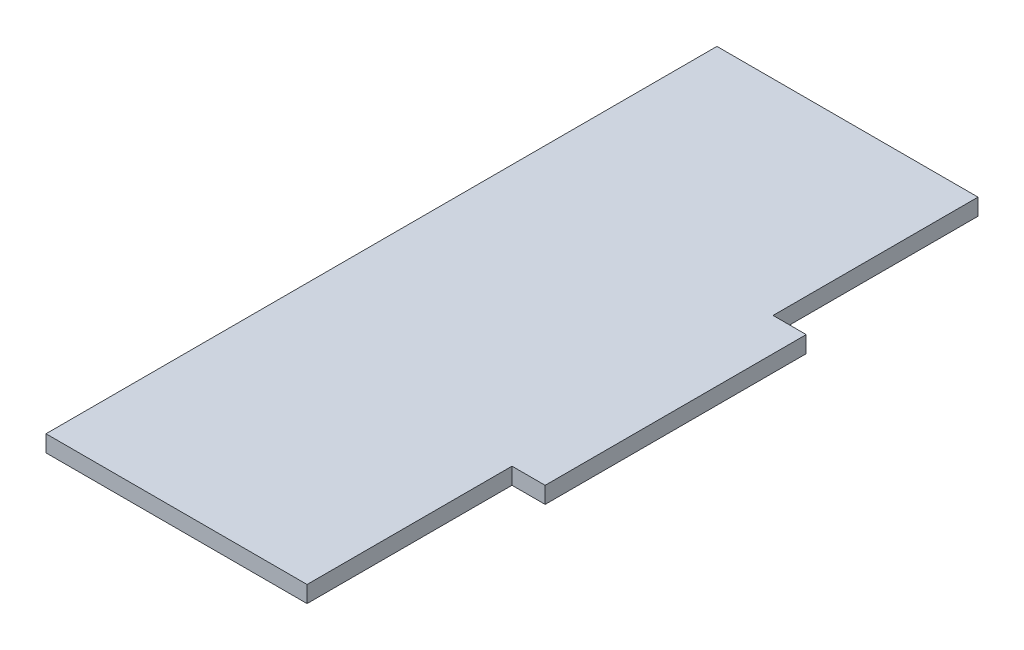
ISO-10303-21;
HEADER;
FILE_DESCRIPTION(('STEP AP214'),'2;1');
FILE_NAME('part.step','',(''),(''),'','','');
FILE_SCHEMA(('AUTOMOTIVE_DESIGN { 1 0 10303 214 1 1 1 1 }'));
ENDSEC;
DATA;
#1=APPLICATION_CONTEXT('core data for automotive mechanical design processes');
#2=APPLICATION_PROTOCOL_DEFINITION('international standard','automotive_design',2000,#1);
#3=PRODUCT_CONTEXT('',#1,'mechanical');
#4=PRODUCT('Part','Part','',(#3));
#5=PRODUCT_RELATED_PRODUCT_CATEGORY('part','',(#4));
#6=PRODUCT_DEFINITION_FORMATION('','',#4);
#7=PRODUCT_DEFINITION_CONTEXT('part definition',#1,'design');
#8=PRODUCT_DEFINITION('design','',#6,#7);
#9=PRODUCT_DEFINITION_SHAPE('','',#8);
#10=(LENGTH_UNIT() NAMED_UNIT(*) SI_UNIT(.MILLI.,.METRE.));
#11=(NAMED_UNIT(*) PLANE_ANGLE_UNIT() SI_UNIT($,.RADIAN.));
#12=(NAMED_UNIT(*) SI_UNIT($,.STERADIAN.) SOLID_ANGLE_UNIT());
#13=UNCERTAINTY_MEASURE_WITH_UNIT(LENGTH_MEASURE(1.E-05),#10,'distance_accuracy_value','');
#14=(GEOMETRIC_REPRESENTATION_CONTEXT(3) GLOBAL_UNCERTAINTY_ASSIGNED_CONTEXT((#13)) GLOBAL_UNIT_ASSIGNED_CONTEXT((#10,
#11,#12)) REPRESENTATION_CONTEXT('',''));
#15=CARTESIAN_POINT('',(0.,0.,0.));
#16=DIRECTION('',(0.,0.,1.));
#17=DIRECTION('',(1.,0.,0.));
#18=AXIS2_PLACEMENT_3D('',#15,#16,#17);
#19=CARTESIAN_POINT('',(-25.,3.175,0.));
#20=DIRECTION('',(-1.,0.,0.));
#21=DIRECTION('',(0.,0.,1.));
#22=AXIS2_PLACEMENT_3D('',#19,#20,#21);
#23=PLANE('',#22);
#24=DIRECTION('',(0.,0.,-1.));
#25=VECTOR('',#24,1.);
#26=CARTESIAN_POINT('',(-25.,0.,0.));
#27=LINE('',#26,#25);
#28=CARTESIAN_POINT('',(-25.,0.,89.25));
#29=VERTEX_POINT('',#28);
#30=CARTESIAN_POINT('',(-25.,0.,-39.25));
#31=VERTEX_POINT('',#30);
#32=EDGE_CURVE('E127',#29,#31,#27,.T.);
#33=ORIENTED_EDGE('',*,*,#32,.F.);
#34=DIRECTION('',(0.,-1.,0.));
#35=VECTOR('',#34,1.);
#36=CARTESIAN_POINT('',(-25.,3.175,89.25));
#37=LINE('',#36,#35);
#38=CARTESIAN_POINT('',(-25.,3.175,89.25));
#39=VERTEX_POINT('',#38);
#40=EDGE_CURVE('E11',#39,#29,#37,.T.);
#41=ORIENTED_EDGE('',*,*,#40,.F.);
#42=DIRECTION('',(0.,0.,-1.));
#43=VECTOR('',#42,1.);
#44=CARTESIAN_POINT('',(-25.,3.175,0.));
#45=LINE('',#44,#43);
#46=CARTESIAN_POINT('',(-25.,3.175,-39.25));
#47=VERTEX_POINT('',#46);
#48=EDGE_CURVE('E147',#39,#47,#45,.T.);
#49=ORIENTED_EDGE('',*,*,#48,.T.);
#50=DIRECTION('',(0.,-1.,0.));
#51=VECTOR('',#50,1.);
#52=CARTESIAN_POINT('',(-25.,3.175,-39.25));
#53=LINE('',#52,#51);
#54=EDGE_CURVE('E50',#47,#31,#53,.T.);
#55=ORIENTED_EDGE('',*,*,#54,.T.);
#56=EDGE_LOOP('',(#33,#41,#49,#55));
#57=FACE_BOUND('',#56,.T.);
#58=ADVANCED_FACE('F34',(#57),#23,.T.);
#59=CARTESIAN_POINT('',(0.,3.175,89.25));
#60=DIRECTION('',(0.,0.,1.));
#61=DIRECTION('',(1.,0.,0.));
#62=AXIS2_PLACEMENT_3D('',#59,#60,#61);
#63=PLANE('',#62);
#64=DIRECTION('',(-1.,0.,0.));
#65=VECTOR('',#64,1.);
#66=CARTESIAN_POINT('',(0.,0.,89.25));
#67=LINE('',#66,#65);
#68=CARTESIAN_POINT('',(25.,0.,89.25));
#69=VERTEX_POINT('',#68);
#70=EDGE_CURVE('E129',#69,#29,#67,.T.);
#71=ORIENTED_EDGE('',*,*,#70,.F.);
#72=DIRECTION('',(0.,-1.,0.));
#73=VECTOR('',#72,1.);
#74=CARTESIAN_POINT('',(25.,3.175,89.25));
#75=LINE('',#74,#73);
#76=CARTESIAN_POINT('',(25.,3.175,89.25));
#77=VERTEX_POINT('',#76);
#78=EDGE_CURVE('E42',#77,#69,#75,.T.);
#79=ORIENTED_EDGE('',*,*,#78,.F.);
#80=DIRECTION('',(-1.,0.,0.));
#81=VECTOR('',#80,1.);
#82=CARTESIAN_POINT('',(0.,3.175,89.25));
#83=LINE('',#82,#81);
#84=EDGE_CURVE('E173',#77,#39,#83,.T.);
#85=ORIENTED_EDGE('',*,*,#84,.T.);
#86=ORIENTED_EDGE('',*,*,#40,.T.);
#87=EDGE_LOOP('',(#71,#79,#85,#86));
#88=FACE_BOUND('',#87,.T.);
#89=ADVANCED_FACE('F164',(#88),#63,.T.);
#90=CARTESIAN_POINT('',(25.,3.175,0.));
#91=DIRECTION('',(1.,0.,0.));
#92=DIRECTION('',(0.,0.,-1.));
#93=AXIS2_PLACEMENT_3D('',#90,#91,#92);
#94=PLANE('',#93);
#95=DIRECTION('',(0.,0.,1.));
#96=VECTOR('',#95,1.);
#97=CARTESIAN_POINT('',(25.,0.,0.));
#98=LINE('',#97,#96);
#99=CARTESIAN_POINT('',(25.,0.,50.));
#100=VERTEX_POINT('',#99);
#101=EDGE_CURVE('E132',#100,#69,#98,.T.);
#102=ORIENTED_EDGE('',*,*,#101,.F.);
#103=DIRECTION('',(0.,-1.,0.));
#104=VECTOR('',#103,1.);
#105=CARTESIAN_POINT('',(25.,3.175,50.));
#106=LINE('',#105,#104);
#107=CARTESIAN_POINT('',(25.,3.175,50.));
#108=VERTEX_POINT('',#107);
#109=EDGE_CURVE('E153',#108,#100,#106,.T.);
#110=ORIENTED_EDGE('',*,*,#109,.F.);
#111=DIRECTION('',(0.,0.,1.));
#112=VECTOR('',#111,1.);
#113=CARTESIAN_POINT('',(25.,3.175,0.));
#114=LINE('',#113,#112);
#115=EDGE_CURVE('E160',#108,#77,#114,.T.);
#116=ORIENTED_EDGE('',*,*,#115,.T.);
#117=ORIENTED_EDGE('',*,*,#78,.T.);
#118=EDGE_LOOP('',(#102,#110,#116,#117));
#119=FACE_BOUND('',#118,.T.);
#120=ADVANCED_FACE('F158',(#119),#94,.T.);
#121=CARTESIAN_POINT('',(0.,3.175,50.));
#122=DIRECTION('',(0.,0.,1.));
#123=DIRECTION('',(1.,0.,0.));
#124=AXIS2_PLACEMENT_3D('',#121,#122,#123);
#125=PLANE('',#124);
#126=DIRECTION('',(-1.,0.,0.));
#127=VECTOR('',#126,1.);
#128=CARTESIAN_POINT('',(0.,0.,50.));
#129=LINE('',#128,#127);
#130=CARTESIAN_POINT('',(31.35,0.,50.));
#131=VERTEX_POINT('',#130);
#132=EDGE_CURVE('E135',#131,#100,#129,.T.);
#133=ORIENTED_EDGE('',*,*,#132,.F.);
#134=DIRECTION('',(0.,-1.,0.));
#135=VECTOR('',#134,1.);
#136=CARTESIAN_POINT('',(31.35,3.175,50.));
#137=LINE('',#136,#135);
#138=CARTESIAN_POINT('',(31.35,3.175,50.));
#139=VERTEX_POINT('',#138);
#140=EDGE_CURVE('E151',#139,#131,#137,.T.);
#141=ORIENTED_EDGE('',*,*,#140,.F.);
#142=DIRECTION('',(-1.,0.,0.));
#143=VECTOR('',#142,1.);
#144=CARTESIAN_POINT('',(0.,3.175,50.));
#145=LINE('',#144,#143);
#146=EDGE_CURVE('E172',#139,#108,#145,.T.);
#147=ORIENTED_EDGE('',*,*,#146,.T.);
#148=ORIENTED_EDGE('',*,*,#109,.T.);
#149=EDGE_LOOP('',(#133,#141,#147,#148));
#150=FACE_BOUND('',#149,.T.);
#151=ADVANCED_FACE('F170',(#150),#125,.T.);
#152=CARTESIAN_POINT('',(31.35,3.175,0.));
#153=DIRECTION('',(1.,0.,0.));
#154=DIRECTION('',(0.,0.,-1.));
#155=AXIS2_PLACEMENT_3D('',#152,#153,#154);
#156=PLANE('',#155);
#157=DIRECTION('',(0.,0.,1.));
#158=VECTOR('',#157,1.);
#159=CARTESIAN_POINT('',(31.35,0.,0.));
#160=LINE('',#159,#158);
#161=CARTESIAN_POINT('',(31.35,0.,0.));
#162=VERTEX_POINT('',#161);
#163=EDGE_CURVE('E138',#162,#131,#160,.T.);
#164=ORIENTED_EDGE('',*,*,#163,.F.);
#165=DIRECTION('',(0.,-1.,0.));
#166=VECTOR('',#165,1.);
#167=CARTESIAN_POINT('',(31.35,3.175,0.));
#168=LINE('',#167,#166);
#169=CARTESIAN_POINT('',(31.35,3.175,0.));
#170=VERTEX_POINT('',#169);
#171=EDGE_CURVE('E109',#170,#162,#168,.T.);
#172=ORIENTED_EDGE('',*,*,#171,.F.);
#173=DIRECTION('',(0.,0.,1.));
#174=VECTOR('',#173,1.);
#175=CARTESIAN_POINT('',(31.35,3.175,0.));
#176=LINE('',#175,#174);
#177=EDGE_CURVE('E119',#170,#139,#176,.T.);
#178=ORIENTED_EDGE('',*,*,#177,.T.);
#179=ORIENTED_EDGE('',*,*,#140,.T.);
#180=EDGE_LOOP('',(#164,#172,#178,#179));
#181=FACE_BOUND('',#180,.T.);
#182=ADVANCED_FACE('F179',(#181),#156,.T.);
#183=CARTESIAN_POINT('',(0.,3.175,0.));
#184=DIRECTION('',(0.,0.,-1.));
#185=DIRECTION('',(-1.,0.,0.));
#186=AXIS2_PLACEMENT_3D('',#183,#184,#185);
#187=PLANE('',#186);
#188=DIRECTION('',(1.,0.,0.));
#189=VECTOR('',#188,1.);
#190=CARTESIAN_POINT('',(0.,0.,0.));
#191=LINE('',#190,#189);
#192=CARTESIAN_POINT('',(25.,0.,0.));
#193=VERTEX_POINT('',#192);
#194=EDGE_CURVE('E105',#193,#162,#191,.T.);
#195=ORIENTED_EDGE('',*,*,#194,.F.);
#196=DIRECTION('',(0.,-1.,0.));
#197=VECTOR('',#196,1.);
#198=CARTESIAN_POINT('',(25.,3.175,0.));
#199=LINE('',#198,#197);
#200=CARTESIAN_POINT('',(25.,3.175,0.));
#201=VERTEX_POINT('',#200);
#202=EDGE_CURVE('E100',#201,#193,#199,.T.);
#203=ORIENTED_EDGE('',*,*,#202,.F.);
#204=DIRECTION('',(1.,0.,0.));
#205=VECTOR('',#204,1.);
#206=CARTESIAN_POINT('',(0.,3.175,0.));
#207=LINE('',#206,#205);
#208=EDGE_CURVE('E103',#201,#170,#207,.T.);
#209=ORIENTED_EDGE('',*,*,#208,.T.);
#210=ORIENTED_EDGE('',*,*,#171,.T.);
#211=EDGE_LOOP('',(#195,#203,#209,#210));
#212=FACE_BOUND('',#211,.T.);
#213=ADVANCED_FACE('F102',(#212),#187,.T.);
#214=CARTESIAN_POINT('',(25.,3.175,0.));
#215=DIRECTION('',(1.,0.,0.));
#216=DIRECTION('',(0.,0.,-1.));
#217=AXIS2_PLACEMENT_3D('',#214,#215,#216);
#218=PLANE('',#217);
#219=DIRECTION('',(0.,0.,1.));
#220=VECTOR('',#219,1.);
#221=CARTESIAN_POINT('',(25.,0.,0.));
#222=LINE('',#221,#220);
#223=CARTESIAN_POINT('',(25.,0.,-39.25));
#224=VERTEX_POINT('',#223);
#225=EDGE_CURVE('E142',#224,#193,#222,.T.);
#226=ORIENTED_EDGE('',*,*,#225,.F.);
#227=DIRECTION('',(0.,-1.,0.));
#228=VECTOR('',#227,1.);
#229=CARTESIAN_POINT('',(25.,3.175,-39.25));
#230=LINE('',#229,#228);
#231=CARTESIAN_POINT('',(25.,3.175,-39.25));
#232=VERTEX_POINT('',#231);
#233=EDGE_CURVE('E75',#232,#224,#230,.T.);
#234=ORIENTED_EDGE('',*,*,#233,.F.);
#235=DIRECTION('',(0.,0.,1.));
#236=VECTOR('',#235,1.);
#237=CARTESIAN_POINT('',(25.,3.175,0.));
#238=LINE('',#237,#236);
#239=EDGE_CURVE('E116',#232,#201,#238,.T.);
#240=ORIENTED_EDGE('',*,*,#239,.T.);
#241=ORIENTED_EDGE('',*,*,#202,.T.);
#242=EDGE_LOOP('',(#226,#234,#240,#241));
#243=FACE_BOUND('',#242,.T.);
#244=ADVANCED_FACE('F121',(#243),#218,.T.);
#245=CARTESIAN_POINT('',(0.,3.175,-39.25));
#246=DIRECTION('',(0.,0.,-1.));
#247=DIRECTION('',(-1.,0.,0.));
#248=AXIS2_PLACEMENT_3D('',#245,#246,#247);
#249=PLANE('',#248);
#250=DIRECTION('',(1.,0.,0.));
#251=VECTOR('',#250,1.);
#252=CARTESIAN_POINT('',(0.,0.,-39.25));
#253=LINE('',#252,#251);
#254=EDGE_CURVE('E144',#31,#224,#253,.T.);
#255=ORIENTED_EDGE('',*,*,#254,.F.);
#256=ORIENTED_EDGE('',*,*,#54,.F.);
#257=DIRECTION('',(1.,0.,0.));
#258=VECTOR('',#257,1.);
#259=CARTESIAN_POINT('',(0.,3.175,-39.25));
#260=LINE('',#259,#258);
#261=EDGE_CURVE('E122',#47,#232,#260,.T.);
#262=ORIENTED_EDGE('',*,*,#261,.T.);
#263=ORIENTED_EDGE('',*,*,#233,.T.);
#264=EDGE_LOOP('',(#255,#256,#262,#263));
#265=FACE_BOUND('',#264,.T.);
#266=ADVANCED_FACE('F180',(#265),#249,.T.);
#267=CARTESIAN_POINT('',(0.,3.175,0.));
#268=DIRECTION('',(0.,1.,0.));
#269=DIRECTION('',(0.,0.,1.));
#270=AXIS2_PLACEMENT_3D('',#267,#268,#269);
#271=PLANE('',#270);
#272=ORIENTED_EDGE('',*,*,#48,.F.);
#273=ORIENTED_EDGE('',*,*,#84,.F.);
#274=ORIENTED_EDGE('',*,*,#115,.F.);
#275=ORIENTED_EDGE('',*,*,#146,.F.);
#276=ORIENTED_EDGE('',*,*,#177,.F.);
#277=ORIENTED_EDGE('',*,*,#208,.F.);
#278=ORIENTED_EDGE('',*,*,#239,.F.);
#279=ORIENTED_EDGE('',*,*,#261,.F.);
#280=EDGE_LOOP('',(#272,#273,#274,#275,#276,#277,#278,#279));
#281=FACE_BOUND('',#280,.T.);
#282=ADVANCED_FACE('F114',(#281),#271,.T.);
#283=CARTESIAN_POINT('',(0.,0.,0.));
#284=DIRECTION('',(0.,1.,0.));
#285=DIRECTION('',(0.,0.,1.));
#286=AXIS2_PLACEMENT_3D('',#283,#284,#285);
#287=PLANE('',#286);
#288=ORIENTED_EDGE('',*,*,#32,.T.);
#289=ORIENTED_EDGE('',*,*,#254,.T.);
#290=ORIENTED_EDGE('',*,*,#225,.T.);
#291=ORIENTED_EDGE('',*,*,#194,.T.);
#292=ORIENTED_EDGE('',*,*,#163,.T.);
#293=ORIENTED_EDGE('',*,*,#132,.T.);
#294=ORIENTED_EDGE('',*,*,#101,.T.);
#295=ORIENTED_EDGE('',*,*,#70,.T.);
#296=EDGE_LOOP('',(#288,#289,#290,#291,#292,#293,#294,#295));
#297=FACE_BOUND('',#296,.T.);
#298=ADVANCED_FACE('F166',(#297),#287,.F.);
#299=CLOSED_SHELL('',(#58,#89,#120,#151,#182,#213,#244,#266,#282,#298));
#300=MANIFOLD_SOLID_BREP('B2',#299);
#301=ADVANCED_BREP_SHAPE_REPRESENTATION('',(#18,#300),#14);
#302=SHAPE_DEFINITION_REPRESENTATION(#9,#301);
ENDSEC;
END-ISO-10303-21;
